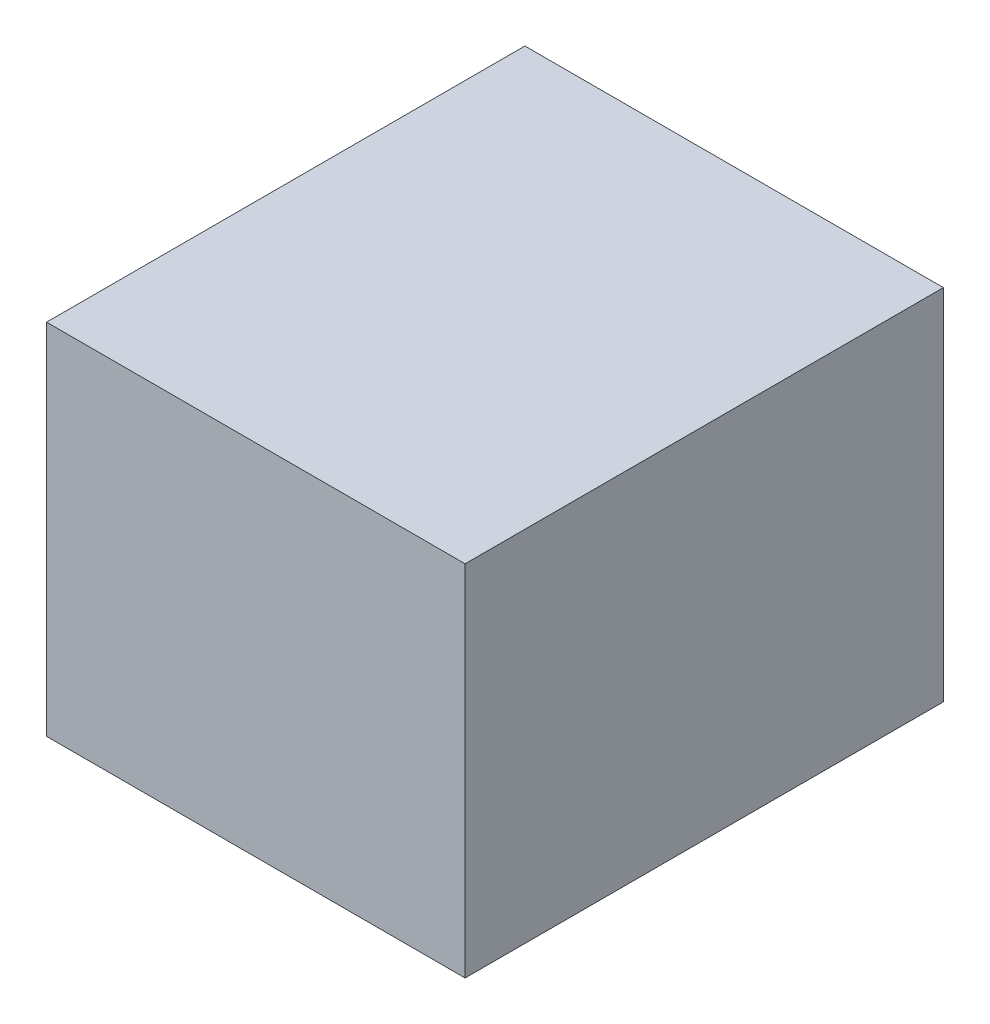
ISO-10303-21;
HEADER;
FILE_DESCRIPTION(('STEP AP214'),'2;1');
FILE_NAME('part.step','',(''),(''),'','','');
FILE_SCHEMA(('AUTOMOTIVE_DESIGN { 1 0 10303 214 1 1 1 1 }'));
ENDSEC;
DATA;
#1=APPLICATION_CONTEXT('core data for automotive mechanical design processes');
#2=APPLICATION_PROTOCOL_DEFINITION('international standard','automotive_design',2000,#1);
#3=PRODUCT_CONTEXT('',#1,'mechanical');
#4=PRODUCT('Part','Part','',(#3));
#5=PRODUCT_RELATED_PRODUCT_CATEGORY('part','',(#4));
#6=PRODUCT_DEFINITION_FORMATION('','',#4);
#7=PRODUCT_DEFINITION_CONTEXT('part definition',#1,'design');
#8=PRODUCT_DEFINITION('design','',#6,#7);
#9=PRODUCT_DEFINITION_SHAPE('','',#8);
#10=(LENGTH_UNIT() NAMED_UNIT(*) SI_UNIT(.MILLI.,.METRE.));
#11=(NAMED_UNIT(*) PLANE_ANGLE_UNIT() SI_UNIT($,.RADIAN.));
#12=(NAMED_UNIT(*) SI_UNIT($,.STERADIAN.) SOLID_ANGLE_UNIT());
#13=UNCERTAINTY_MEASURE_WITH_UNIT(LENGTH_MEASURE(1.E-05),#10,'distance_accuracy_value','');
#14=(GEOMETRIC_REPRESENTATION_CONTEXT(3) GLOBAL_UNCERTAINTY_ASSIGNED_CONTEXT((#13)) GLOBAL_UNIT_ASSIGNED_CONTEXT((#10,
#11,#12)) REPRESENTATION_CONTEXT('',''));
#15=CARTESIAN_POINT('',(0.,0.,0.));
#16=DIRECTION('',(0.,0.,1.));
#17=DIRECTION('',(1.,0.,0.));
#18=AXIS2_PLACEMENT_3D('',#15,#16,#17);
#19=CARTESIAN_POINT('',(-355.6,304.8,-406.4));
#20=DIRECTION('',(1.,0.,0.));
#21=DIRECTION('',(0.,0.,-1.));
#22=AXIS2_PLACEMENT_3D('',#19,#20,#21);
#23=PLANE('',#22);
#24=DIRECTION('',(0.,0.,1.));
#25=VECTOR('',#24,1.);
#26=CARTESIAN_POINT('',(-355.6,-304.8,-406.4));
#27=LINE('',#26,#25);
#28=CARTESIAN_POINT('',(-355.6,-304.8,-406.4));
#29=VERTEX_POINT('',#28);
#30=CARTESIAN_POINT('',(-355.6,-304.8,406.4));
#31=VERTEX_POINT('',#30);
#32=EDGE_CURVE('E98',#29,#31,#27,.T.);
#33=ORIENTED_EDGE('',*,*,#32,.T.);
#34=DIRECTION('',(0.,-1.,0.));
#35=VECTOR('',#34,1.);
#36=CARTESIAN_POINT('',(-355.6,304.8,406.4));
#37=LINE('',#36,#35);
#38=CARTESIAN_POINT('',(-355.6,304.8,406.4));
#39=VERTEX_POINT('',#38);
#40=EDGE_CURVE('E11',#39,#31,#37,.T.);
#41=ORIENTED_EDGE('',*,*,#40,.F.);
#42=DIRECTION('',(0.,0.,1.));
#43=VECTOR('',#42,1.);
#44=CARTESIAN_POINT('',(-355.6,304.8,-406.4));
#45=LINE('',#44,#43);
#46=CARTESIAN_POINT('',(-355.6,304.8,-406.4));
#47=VERTEX_POINT('',#46);
#48=EDGE_CURVE('E86',#47,#39,#45,.T.);
#49=ORIENTED_EDGE('',*,*,#48,.F.);
#50=DIRECTION('',(0.,-1.,0.));
#51=VECTOR('',#50,1.);
#52=CARTESIAN_POINT('',(-355.6,304.8,-406.4));
#53=LINE('',#52,#51);
#54=EDGE_CURVE('E94',#47,#29,#53,.T.);
#55=ORIENTED_EDGE('',*,*,#54,.T.);
#56=EDGE_LOOP('',(#33,#41,#49,#55));
#57=FACE_BOUND('',#56,.T.);
#58=ADVANCED_FACE('F35',(#57),#23,.F.);
#59=CARTESIAN_POINT('',(-355.6,304.8,406.4));
#60=DIRECTION('',(0.,0.,-1.));
#61=DIRECTION('',(-1.,0.,0.));
#62=AXIS2_PLACEMENT_3D('',#59,#60,#61);
#63=PLANE('',#62);
#64=DIRECTION('',(1.,0.,0.));
#65=VECTOR('',#64,1.);
#66=CARTESIAN_POINT('',(-355.6,-304.8,406.4));
#67=LINE('',#66,#65);
#68=CARTESIAN_POINT('',(355.6,-304.8,406.4));
#69=VERTEX_POINT('',#68);
#70=EDGE_CURVE('E90',#31,#69,#67,.T.);
#71=ORIENTED_EDGE('',*,*,#70,.T.);
#72=DIRECTION('',(0.,-1.,0.));
#73=VECTOR('',#72,1.);
#74=CARTESIAN_POINT('',(355.6,304.8,406.4));
#75=LINE('',#74,#73);
#76=CARTESIAN_POINT('',(355.6,304.8,406.4));
#77=VERTEX_POINT('',#76);
#78=EDGE_CURVE('E43',#77,#69,#75,.T.);
#79=ORIENTED_EDGE('',*,*,#78,.F.);
#80=DIRECTION('',(1.,0.,0.));
#81=VECTOR('',#80,1.);
#82=CARTESIAN_POINT('',(-355.6,304.8,406.4));
#83=LINE('',#82,#81);
#84=EDGE_CURVE('E81',#39,#77,#83,.T.);
#85=ORIENTED_EDGE('',*,*,#84,.F.);
#86=ORIENTED_EDGE('',*,*,#40,.T.);
#87=EDGE_LOOP('',(#71,#79,#85,#86));
#88=FACE_BOUND('',#87,.T.);
#89=ADVANCED_FACE('F89',(#88),#63,.F.);
#90=CARTESIAN_POINT('',(355.6,304.8,-406.4));
#91=DIRECTION('',(-1.,0.,0.));
#92=DIRECTION('',(0.,0.,1.));
#93=AXIS2_PLACEMENT_3D('',#90,#91,#92);
#94=PLANE('',#93);
#95=DIRECTION('',(0.,0.,-1.));
#96=VECTOR('',#95,1.);
#97=CARTESIAN_POINT('',(355.6,-304.8,-406.4));
#98=LINE('',#97,#96);
#99=CARTESIAN_POINT('',(355.6,-304.8,-406.4));
#100=VERTEX_POINT('',#99);
#101=EDGE_CURVE('E68',#69,#100,#98,.T.);
#102=ORIENTED_EDGE('',*,*,#101,.T.);
#103=DIRECTION('',(0.,-1.,0.));
#104=VECTOR('',#103,1.);
#105=CARTESIAN_POINT('',(355.6,304.8,-406.4));
#106=LINE('',#105,#104);
#107=CARTESIAN_POINT('',(355.6,304.8,-406.4));
#108=VERTEX_POINT('',#107);
#109=EDGE_CURVE('E91',#108,#100,#106,.T.);
#110=ORIENTED_EDGE('',*,*,#109,.F.);
#111=DIRECTION('',(0.,0.,-1.));
#112=VECTOR('',#111,1.);
#113=CARTESIAN_POINT('',(355.6,304.8,-406.4));
#114=LINE('',#113,#112);
#115=EDGE_CURVE('E84',#77,#108,#114,.T.);
#116=ORIENTED_EDGE('',*,*,#115,.F.);
#117=ORIENTED_EDGE('',*,*,#78,.T.);
#118=EDGE_LOOP('',(#102,#110,#116,#117));
#119=FACE_BOUND('',#118,.T.);
#120=ADVANCED_FACE('F92',(#119),#94,.F.);
#121=CARTESIAN_POINT('',(-355.6,304.8,-406.4));
#122=DIRECTION('',(0.,0.,1.));
#123=DIRECTION('',(1.,0.,0.));
#124=AXIS2_PLACEMENT_3D('',#121,#122,#123);
#125=PLANE('',#124);
#126=DIRECTION('',(-1.,0.,0.));
#127=VECTOR('',#126,1.);
#128=CARTESIAN_POINT('',(-355.6,-304.8,-406.4));
#129=LINE('',#128,#127);
#130=EDGE_CURVE('E74',#100,#29,#129,.T.);
#131=ORIENTED_EDGE('',*,*,#130,.T.);
#132=ORIENTED_EDGE('',*,*,#54,.F.);
#133=DIRECTION('',(-1.,0.,0.));
#134=VECTOR('',#133,1.);
#135=CARTESIAN_POINT('',(-355.6,304.8,-406.4));
#136=LINE('',#135,#134);
#137=EDGE_CURVE('E51',#108,#47,#136,.T.);
#138=ORIENTED_EDGE('',*,*,#137,.F.);
#139=ORIENTED_EDGE('',*,*,#109,.T.);
#140=EDGE_LOOP('',(#131,#132,#138,#139));
#141=FACE_BOUND('',#140,.T.);
#142=ADVANCED_FACE('F105',(#141),#125,.F.);
#143=CARTESIAN_POINT('',(0.,304.8,0.));
#144=DIRECTION('',(0.,1.,0.));
#145=DIRECTION('',(0.,0.,1.));
#146=AXIS2_PLACEMENT_3D('',#143,#144,#145);
#147=PLANE('',#146);
#148=ORIENTED_EDGE('',*,*,#48,.T.);
#149=ORIENTED_EDGE('',*,*,#84,.T.);
#150=ORIENTED_EDGE('',*,*,#115,.T.);
#151=ORIENTED_EDGE('',*,*,#137,.T.);
#152=EDGE_LOOP('',(#148,#149,#150,#151));
#153=FACE_BOUND('',#152,.T.);
#154=ADVANCED_FACE('F82',(#153),#147,.T.);
#155=CARTESIAN_POINT('',(0.,-304.8,0.));
#156=DIRECTION('',(0.,1.,0.));
#157=DIRECTION('',(0.,0.,1.));
#158=AXIS2_PLACEMENT_3D('',#155,#156,#157);
#159=PLANE('',#158);
#160=ORIENTED_EDGE('',*,*,#32,.F.);
#161=ORIENTED_EDGE('',*,*,#130,.F.);
#162=ORIENTED_EDGE('',*,*,#101,.F.);
#163=ORIENTED_EDGE('',*,*,#70,.F.);
#164=EDGE_LOOP('',(#160,#161,#162,#163));
#165=FACE_BOUND('',#164,.T.);
#166=ADVANCED_FACE('F108',(#165),#159,.F.);
#167=CLOSED_SHELL('',(#58,#89,#120,#142,#154,#166));
#168=MANIFOLD_SOLID_BREP('B2',#167);
#169=ADVANCED_BREP_SHAPE_REPRESENTATION('',(#18,#168),#14);
#170=SHAPE_DEFINITION_REPRESENTATION(#9,#169);
ENDSEC;
END-ISO-10303-21;
